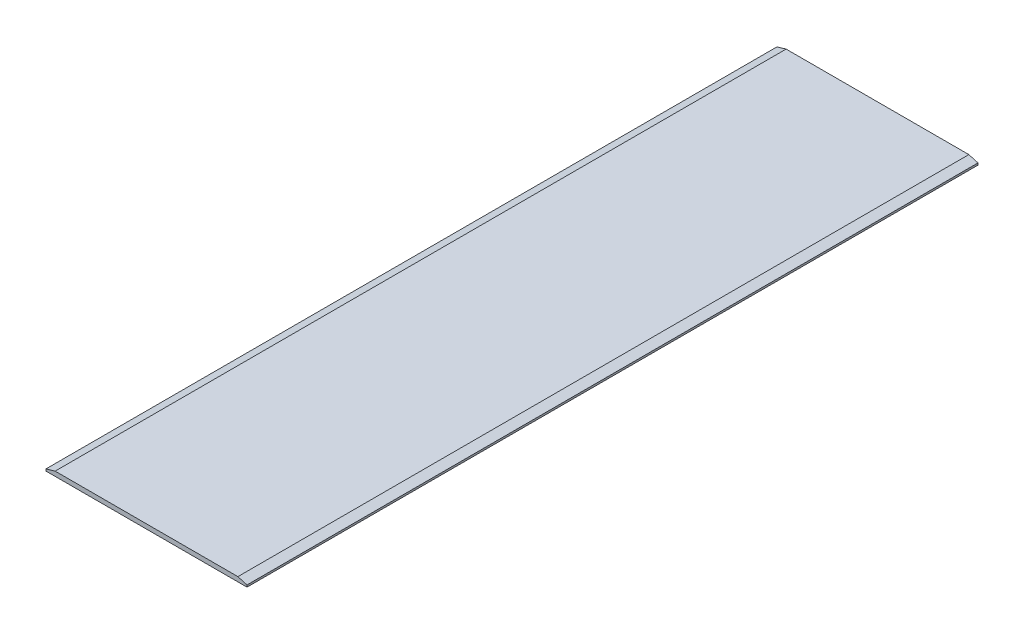
ISO-10303-21;
HEADER;
FILE_DESCRIPTION(('STEP AP214'),'2;1');
FILE_NAME('part.step','',(''),(''),'','','');
FILE_SCHEMA(('AUTOMOTIVE_DESIGN { 1 0 10303 214 1 1 1 1 }'));
ENDSEC;
DATA;
#1=APPLICATION_CONTEXT('core data for automotive mechanical design processes');
#2=APPLICATION_PROTOCOL_DEFINITION('international standard','automotive_design',2000,#1);
#3=PRODUCT_CONTEXT('',#1,'mechanical');
#4=PRODUCT('Part','Part','',(#3));
#5=PRODUCT_RELATED_PRODUCT_CATEGORY('part','',(#4));
#6=PRODUCT_DEFINITION_FORMATION('','',#4);
#7=PRODUCT_DEFINITION_CONTEXT('part definition',#1,'design');
#8=PRODUCT_DEFINITION('design','',#6,#7);
#9=PRODUCT_DEFINITION_SHAPE('','',#8);
#10=(LENGTH_UNIT() NAMED_UNIT(*) SI_UNIT(.MILLI.,.METRE.));
#11=(NAMED_UNIT(*) PLANE_ANGLE_UNIT() SI_UNIT($,.RADIAN.));
#12=(NAMED_UNIT(*) SI_UNIT($,.STERADIAN.) SOLID_ANGLE_UNIT());
#13=UNCERTAINTY_MEASURE_WITH_UNIT(LENGTH_MEASURE(1.E-05),#10,'distance_accuracy_value','');
#14=(GEOMETRIC_REPRESENTATION_CONTEXT(3) GLOBAL_UNCERTAINTY_ASSIGNED_CONTEXT((#13)) GLOBAL_UNIT_ASSIGNED_CONTEXT((#10,
#11,#12)) REPRESENTATION_CONTEXT('',''));
#15=CARTESIAN_POINT('',(0.,0.,0.));
#16=DIRECTION('',(0.,0.,1.));
#17=DIRECTION('',(1.,0.,0.));
#18=AXIS2_PLACEMENT_3D('',#15,#16,#17);
#19=CARTESIAN_POINT('',(546.1,9.05833360086324,1016.));
#20=DIRECTION('',(0.275637355817005,0.961261695938317,0.));
#21=DIRECTION('',(-0.961261695938317,0.275637355817005,0.));
#22=AXIS2_PLACEMENT_3D('',#19,#20,#21);
#23=PLANE('',#22);
#24=DIRECTION('',(0.,0.,-1.));
#25=VECTOR('',#24,1.);
#26=CARTESIAN_POINT('',(558.8,5.41666720172648,0.));
#27=LINE('',#26,#25);
#28=CARTESIAN_POINT('',(558.8,5.4166672017264,0.));
#29=VERTEX_POINT('',#28);
#30=CARTESIAN_POINT('',(558.8,5.41666720172644,2032.));
#31=VERTEX_POINT('',#30);
#32=EDGE_CURVE('E81',#29,#31,#27,.F.);
#33=ORIENTED_EDGE('',*,*,#32,.F.);
#34=DIRECTION('',(-0.961261695938321,0.275637355816992,0.));
#35=VECTOR('',#34,1.);
#36=CARTESIAN_POINT('',(558.8,5.41666720172648,0.));
#37=LINE('',#36,#35);
#38=CARTESIAN_POINT('',(533.4,12.7000000000001,0.));
#39=VERTEX_POINT('',#38);
#40=EDGE_CURVE('E101',#29,#39,#37,.T.);
#41=ORIENTED_EDGE('',*,*,#40,.T.);
#42=DIRECTION('',(0.,0.,1.));
#43=VECTOR('',#42,1.);
#44=CARTESIAN_POINT('',(533.4,12.7,0.));
#45=LINE('',#44,#43);
#46=CARTESIAN_POINT('',(533.4,12.7,2032.));
#47=VERTEX_POINT('',#46);
#48=EDGE_CURVE('E19',#47,#39,#45,.F.);
#49=ORIENTED_EDGE('',*,*,#48,.F.);
#50=DIRECTION('',(-0.961261695938321,0.275637355816992,0.));
#51=VECTOR('',#50,1.);
#52=CARTESIAN_POINT('',(558.8,5.41666720172648,2032.));
#53=LINE('',#52,#51);
#54=EDGE_CURVE('E92',#31,#47,#53,.T.);
#55=ORIENTED_EDGE('',*,*,#54,.F.);
#56=EDGE_LOOP('',(#33,#41,#49,#55));
#57=FACE_BOUND('',#56,.T.);
#58=ADVANCED_FACE('F16',(#57),#23,.T.);
#59=CARTESIAN_POINT('',(558.8,12.7,0.));
#60=DIRECTION('',(0.,1.,0.));
#61=DIRECTION('',(0.,0.,1.));
#62=AXIS2_PLACEMENT_3D('',#59,#60,#61);
#63=PLANE('',#62);
#64=DIRECTION('',(1.,0.,0.));
#65=VECTOR('',#64,1.);
#66=CARTESIAN_POINT('',(0.,12.7,2032.));
#67=LINE('',#66,#65);
#68=CARTESIAN_POINT('',(25.4,12.7,2032.));
#69=VERTEX_POINT('',#68);
#70=EDGE_CURVE('E75',#47,#69,#67,.F.);
#71=ORIENTED_EDGE('',*,*,#70,.F.);
#72=ORIENTED_EDGE('',*,*,#48,.T.);
#73=DIRECTION('',(1.,0.,0.));
#74=VECTOR('',#73,1.);
#75=CARTESIAN_POINT('',(0.,12.7,0.));
#76=LINE('',#75,#74);
#77=CARTESIAN_POINT('',(25.4,12.7,0.));
#78=VERTEX_POINT('',#77);
#79=EDGE_CURVE('E78',#39,#78,#76,.F.);
#80=ORIENTED_EDGE('',*,*,#79,.T.);
#81=DIRECTION('',(0.,0.,1.));
#82=VECTOR('',#81,1.);
#83=CARTESIAN_POINT('',(25.3999999999999,12.7000000000002,1016.));
#84=LINE('',#83,#82);
#85=EDGE_CURVE('E71',#69,#78,#84,.F.);
#86=ORIENTED_EDGE('',*,*,#85,.F.);
#87=EDGE_LOOP('',(#71,#72,#80,#86));
#88=FACE_BOUND('',#87,.T.);
#89=ADVANCED_FACE('F73',(#88),#63,.T.);
#90=CARTESIAN_POINT('',(12.7,9.05833360086324,1016.));
#91=DIRECTION('',(-0.275637355817005,0.961261695938317,0.));
#92=DIRECTION('',(-0.961261695938317,-0.275637355817005,0.));
#93=AXIS2_PLACEMENT_3D('',#90,#91,#92);
#94=PLANE('',#93);
#95=ORIENTED_EDGE('',*,*,#85,.T.);
#96=DIRECTION('',(-0.961261695938321,-0.275637355816992,0.));
#97=VECTOR('',#96,1.);
#98=CARTESIAN_POINT('',(25.4,12.7,0.));
#99=LINE('',#98,#97);
#100=CARTESIAN_POINT('',(0.,5.4166672017264,0.));
#101=VERTEX_POINT('',#100);
#102=EDGE_CURVE('E104',#78,#101,#99,.T.);
#103=ORIENTED_EDGE('',*,*,#102,.T.);
#104=DIRECTION('',(0.,0.,1.));
#105=VECTOR('',#104,1.);
#106=CARTESIAN_POINT('',(0.,5.41666720172648,0.));
#107=LINE('',#106,#105);
#108=CARTESIAN_POINT('',(0.,5.41666720172644,2032.));
#109=VERTEX_POINT('',#108);
#110=EDGE_CURVE('E85',#109,#101,#107,.F.);
#111=ORIENTED_EDGE('',*,*,#110,.F.);
#112=DIRECTION('',(-0.961261695938321,-0.275637355816992,0.));
#113=VECTOR('',#112,1.);
#114=CARTESIAN_POINT('',(25.4,12.7,2032.));
#115=LINE('',#114,#113);
#116=EDGE_CURVE('E83',#69,#109,#115,.T.);
#117=ORIENTED_EDGE('',*,*,#116,.F.);
#118=EDGE_LOOP('',(#95,#103,#111,#117));
#119=FACE_BOUND('',#118,.T.);
#120=ADVANCED_FACE('F84',(#119),#94,.T.);
#121=CARTESIAN_POINT('',(558.8,0.,0.));
#122=DIRECTION('',(1.,0.,0.));
#123=DIRECTION('',(0.,0.,-1.));
#124=AXIS2_PLACEMENT_3D('',#121,#122,#123);
#125=PLANE('',#124);
#126=DIRECTION('',(0.,1.,0.));
#127=VECTOR('',#126,1.);
#128=CARTESIAN_POINT('',(558.8,0.,0.));
#129=LINE('',#128,#127);
#130=CARTESIAN_POINT('',(558.8,0.,0.));
#131=VERTEX_POINT('',#130);
#132=EDGE_CURVE('E107',#131,#29,#129,.T.);
#133=ORIENTED_EDGE('',*,*,#132,.T.);
#134=ORIENTED_EDGE('',*,*,#32,.T.);
#135=DIRECTION('',(0.,1.,0.));
#136=VECTOR('',#135,1.);
#137=CARTESIAN_POINT('',(558.8,0.,2032.));
#138=LINE('',#137,#136);
#139=CARTESIAN_POINT('',(558.8,0.,2032.));
#140=VERTEX_POINT('',#139);
#141=EDGE_CURVE('E88',#140,#31,#138,.T.);
#142=ORIENTED_EDGE('',*,*,#141,.F.);
#143=DIRECTION('',(0.,0.,-1.));
#144=VECTOR('',#143,1.);
#145=CARTESIAN_POINT('',(558.8,0.,0.));
#146=LINE('',#145,#144);
#147=EDGE_CURVE('E110',#131,#140,#146,.F.);
#148=ORIENTED_EDGE('',*,*,#147,.F.);
#149=EDGE_LOOP('',(#133,#134,#142,#148));
#150=FACE_BOUND('',#149,.T.);
#151=ADVANCED_FACE('F123',(#150),#125,.T.);
#152=CARTESIAN_POINT('',(0.,0.,2032.));
#153=DIRECTION('',(0.,0.,1.));
#154=DIRECTION('',(1.,0.,0.));
#155=AXIS2_PLACEMENT_3D('',#152,#153,#154);
#156=PLANE('',#155);
#157=ORIENTED_EDGE('',*,*,#141,.T.);
#158=ORIENTED_EDGE('',*,*,#54,.T.);
#159=ORIENTED_EDGE('',*,*,#70,.T.);
#160=ORIENTED_EDGE('',*,*,#116,.T.);
#161=DIRECTION('',(0.,1.,0.));
#162=VECTOR('',#161,1.);
#163=CARTESIAN_POINT('',(0.,12.7,2032.));
#164=LINE('',#163,#162);
#165=CARTESIAN_POINT('',(0.,0.,2032.));
#166=VERTEX_POINT('',#165);
#167=EDGE_CURVE('E98',#166,#109,#164,.T.);
#168=ORIENTED_EDGE('',*,*,#167,.F.);
#169=DIRECTION('',(1.,0.,0.));
#170=VECTOR('',#169,1.);
#171=CARTESIAN_POINT('',(0.,0.,2032.));
#172=LINE('',#171,#170);
#173=EDGE_CURVE('E113',#140,#166,#172,.F.);
#174=ORIENTED_EDGE('',*,*,#173,.F.);
#175=EDGE_LOOP('',(#157,#158,#159,#160,#168,#174));
#176=FACE_BOUND('',#175,.T.);
#177=ADVANCED_FACE('F91',(#176),#156,.T.);
#178=CARTESIAN_POINT('',(0.,12.7,0.));
#179=DIRECTION('',(-1.,0.,0.));
#180=DIRECTION('',(0.,0.,1.));
#181=AXIS2_PLACEMENT_3D('',#178,#179,#180);
#182=PLANE('',#181);
#183=ORIENTED_EDGE('',*,*,#167,.T.);
#184=ORIENTED_EDGE('',*,*,#110,.T.);
#185=DIRECTION('',(0.,1.,0.));
#186=VECTOR('',#185,1.);
#187=CARTESIAN_POINT('',(0.,0.,0.));
#188=LINE('',#187,#186);
#189=CARTESIAN_POINT('',(0.,0.,0.));
#190=VERTEX_POINT('',#189);
#191=EDGE_CURVE('E34',#101,#190,#188,.F.);
#192=ORIENTED_EDGE('',*,*,#191,.T.);
#193=DIRECTION('',(0.,0.,-1.));
#194=VECTOR('',#193,1.);
#195=CARTESIAN_POINT('',(0.,0.,0.));
#196=LINE('',#195,#194);
#197=EDGE_CURVE('E25',#166,#190,#196,.T.);
#198=ORIENTED_EDGE('',*,*,#197,.F.);
#199=EDGE_LOOP('',(#183,#184,#192,#198));
#200=FACE_BOUND('',#199,.T.);
#201=ADVANCED_FACE('F120',(#200),#182,.T.);
#202=CARTESIAN_POINT('',(0.,0.,0.));
#203=DIRECTION('',(0.,0.,1.));
#204=DIRECTION('',(1.,0.,0.));
#205=AXIS2_PLACEMENT_3D('',#202,#203,#204);
#206=PLANE('',#205);
#207=DIRECTION('',(1.,0.,0.));
#208=VECTOR('',#207,1.);
#209=CARTESIAN_POINT('',(0.,0.,0.));
#210=LINE('',#209,#208);
#211=EDGE_CURVE('E11',#190,#131,#210,.T.);
#212=ORIENTED_EDGE('',*,*,#211,.F.);
#213=ORIENTED_EDGE('',*,*,#191,.F.);
#214=ORIENTED_EDGE('',*,*,#102,.F.);
#215=ORIENTED_EDGE('',*,*,#79,.F.);
#216=ORIENTED_EDGE('',*,*,#40,.F.);
#217=ORIENTED_EDGE('',*,*,#132,.F.);
#218=EDGE_LOOP('',(#212,#213,#214,#215,#216,#217));
#219=FACE_BOUND('',#218,.T.);
#220=ADVANCED_FACE('F126',(#219),#206,.F.);
#221=CARTESIAN_POINT('',(0.,0.,0.));
#222=DIRECTION('',(0.,-1.,0.));
#223=DIRECTION('',(0.,0.,-1.));
#224=AXIS2_PLACEMENT_3D('',#221,#222,#223);
#225=PLANE('',#224);
#226=ORIENTED_EDGE('',*,*,#197,.T.);
#227=ORIENTED_EDGE('',*,*,#211,.T.);
#228=ORIENTED_EDGE('',*,*,#147,.T.);
#229=ORIENTED_EDGE('',*,*,#173,.T.);
#230=EDGE_LOOP('',(#226,#227,#228,#229));
#231=FACE_BOUND('',#230,.T.);
#232=ADVANCED_FACE('F118',(#231),#225,.T.);
#233=CLOSED_SHELL('',(#58,#89,#120,#151,#177,#201,#220,#232));
#234=MANIFOLD_SOLID_BREP('B1',#233);
#235=ADVANCED_BREP_SHAPE_REPRESENTATION('',(#18,#234),#14);
#236=SHAPE_DEFINITION_REPRESENTATION(#9,#235);
ENDSEC;
END-ISO-10303-21;
